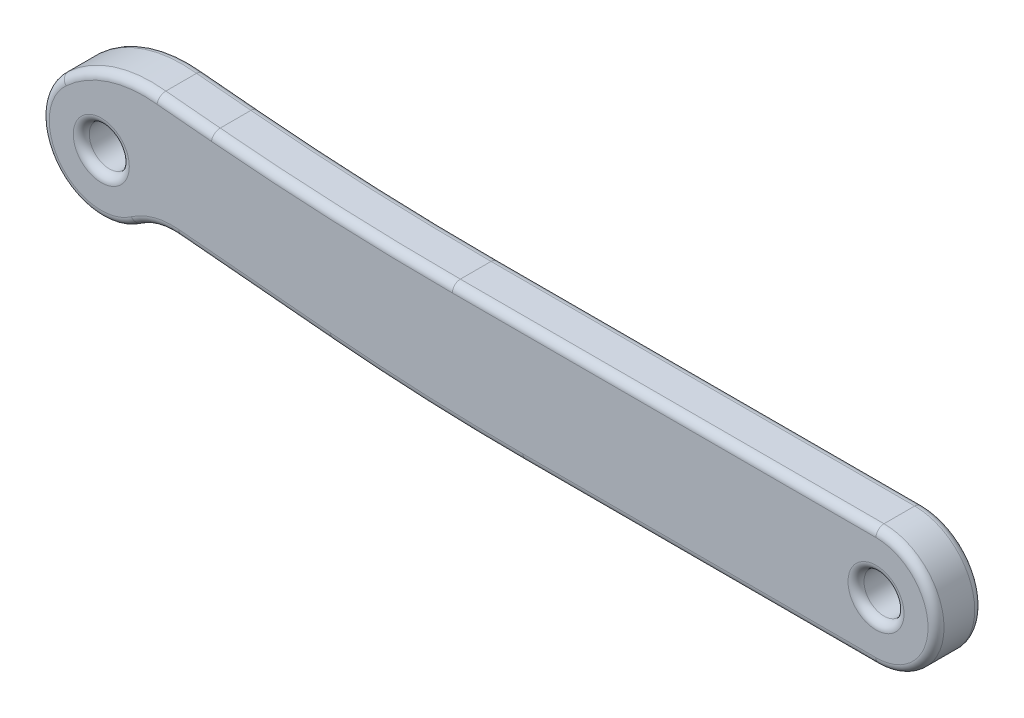
ISO-10303-21;
HEADER;
FILE_DESCRIPTION(('STEP AP214'),'2;1');
FILE_NAME('part.step','',(''),(''),'','','');
FILE_SCHEMA(('AUTOMOTIVE_DESIGN { 1 0 10303 214 1 1 1 1 }'));
ENDSEC;
DATA;
#1=APPLICATION_CONTEXT('core data for automotive mechanical design processes');
#2=APPLICATION_PROTOCOL_DEFINITION('international standard','automotive_design',2000,#1);
#3=PRODUCT_CONTEXT('',#1,'mechanical');
#4=PRODUCT('Part','Part','',(#3));
#5=PRODUCT_RELATED_PRODUCT_CATEGORY('part','',(#4));
#6=PRODUCT_DEFINITION_FORMATION('','',#4);
#7=PRODUCT_DEFINITION_CONTEXT('part definition',#1,'design');
#8=PRODUCT_DEFINITION('design','',#6,#7);
#9=PRODUCT_DEFINITION_SHAPE('','',#8);
#10=(LENGTH_UNIT() NAMED_UNIT(*) SI_UNIT(.MILLI.,.METRE.));
#11=(NAMED_UNIT(*) PLANE_ANGLE_UNIT() SI_UNIT($,.RADIAN.));
#12=(NAMED_UNIT(*) SI_UNIT($,.STERADIAN.) SOLID_ANGLE_UNIT());
#13=UNCERTAINTY_MEASURE_WITH_UNIT(LENGTH_MEASURE(1.E-05),#10,'distance_accuracy_value','');
#14=(GEOMETRIC_REPRESENTATION_CONTEXT(3) GLOBAL_UNCERTAINTY_ASSIGNED_CONTEXT((#13)) GLOBAL_UNIT_ASSIGNED_CONTEXT((#10,
#11,#12)) REPRESENTATION_CONTEXT('',''));
#15=CARTESIAN_POINT('',(0.,0.,0.));
#16=DIRECTION('',(0.,0.,1.));
#17=DIRECTION('',(1.,0.,0.));
#18=AXIS2_PLACEMENT_3D('',#15,#16,#17);
#19=CARTESIAN_POINT('',(0.,0.,1.75));
#20=DIRECTION('',(0.,0.,-1.));
#21=DIRECTION('',(-1.,0.,0.));
#22=AXIS2_PLACEMENT_3D('',#19,#20,#21);
#23=CYLINDRICAL_SURFACE('',#22,2.25);
#24=DIRECTION('',(0.,0.,1.));
#25=VECTOR('',#24,1.);
#26=CARTESIAN_POINT('',(-1.52467335470079,1.65465137157816,0.));
#27=LINE('',#26,#25);
#28=CARTESIAN_POINT('',(-1.52467335470079,1.65465137157816,0.3));
#29=VERTEX_POINT('',#28);
#30=CARTESIAN_POINT('',(-1.52467335470079,1.65465137157816,1.45));
#31=VERTEX_POINT('',#30);
#32=EDGE_CURVE('E458',#29,#31,#27,.T.);
#33=ORIENTED_EDGE('',*,*,#32,.F.);
#34=CARTESIAN_POINT('',(0.,0.,0.3));
#35=DIRECTION('',(0.,0.,1.));
#36=DIRECTION('',(1.,0.,0.));
#37=AXIS2_PLACEMENT_3D('',#34,#35,#36);
#38=CIRCLE('',#37,2.25);
#39=CARTESIAN_POINT('',(1.29610472523494,-1.83918801138537,0.3));
#40=VERTEX_POINT('',#39);
#41=EDGE_CURVE('E261',#29,#40,#38,.T.);
#42=ORIENTED_EDGE('',*,*,#41,.T.);
#43=DIRECTION('',(0.,0.,1.));
#44=VECTOR('',#43,1.);
#45=CARTESIAN_POINT('',(1.29610472523494,-1.83918801138537,0.));
#46=LINE('',#45,#44);
#47=CARTESIAN_POINT('',(1.29610472523494,-1.83918801138537,1.45));
#48=VERTEX_POINT('',#47);
#49=EDGE_CURVE('E405',#40,#48,#46,.T.);
#50=ORIENTED_EDGE('',*,*,#49,.T.);
#51=CARTESIAN_POINT('',(0.,0.,1.45));
#52=DIRECTION('',(0.,0.,1.));
#53=DIRECTION('',(1.,0.,0.));
#54=AXIS2_PLACEMENT_3D('',#51,#52,#53);
#55=CIRCLE('',#54,2.25);
#56=EDGE_CURVE('E259',#48,#31,#55,.F.);
#57=ORIENTED_EDGE('',*,*,#56,.T.);
#58=EDGE_LOOP('',(#33,#42,#50,#57));
#59=FACE_BOUND('',#58,.T.);
#60=ADVANCED_FACE('F34',(#59),#23,.T.);
#61=CARTESIAN_POINT('',(0.,2.25,1.75));
#62=DIRECTION('',(0.,-1.,0.));
#63=DIRECTION('',(0.,0.,-1.));
#64=AXIS2_PLACEMENT_3D('',#61,#62,#63);
#65=PLANE('',#64);
#66=DIRECTION('',(0.,0.,-1.));
#67=VECTOR('',#66,1.);
#68=CARTESIAN_POINT('',(29.04588359,2.25,1.75));
#69=LINE('',#68,#67);
#70=CARTESIAN_POINT('',(29.04588359,2.25,1.45));
#71=VERTEX_POINT('',#70);
#72=CARTESIAN_POINT('',(29.04588359,2.25,0.3));
#73=VERTEX_POINT('',#72);
#74=EDGE_CURVE('E403',#71,#73,#69,.T.);
#75=ORIENTED_EDGE('',*,*,#74,.T.);
#76=DIRECTION('',(-1.,0.,0.));
#77=VECTOR('',#76,1.);
#78=CARTESIAN_POINT('',(0.,2.25,0.3));
#79=LINE('',#78,#77);
#80=CARTESIAN_POINT('',(13.162158488708,2.25,0.3));
#81=VERTEX_POINT('',#80);
#82=EDGE_CURVE('E244',#73,#81,#79,.T.);
#83=ORIENTED_EDGE('',*,*,#82,.T.);
#84=DIRECTION('',(0.,0.,1.));
#85=VECTOR('',#84,1.);
#86=CARTESIAN_POINT('',(13.162158488708,2.25,0.));
#87=LINE('',#86,#85);
#88=CARTESIAN_POINT('',(13.162158488708,2.25,1.45));
#89=VERTEX_POINT('',#88);
#90=EDGE_CURVE('E475',#81,#89,#87,.T.);
#91=ORIENTED_EDGE('',*,*,#90,.T.);
#92=DIRECTION('',(-1.,0.,0.));
#93=VECTOR('',#92,1.);
#94=CARTESIAN_POINT('',(29.04588359,2.25,1.45));
#95=LINE('',#94,#93);
#96=EDGE_CURVE('E242',#89,#71,#95,.F.);
#97=ORIENTED_EDGE('',*,*,#96,.T.);
#98=EDGE_LOOP('',(#75,#83,#91,#97));
#99=FACE_BOUND('',#98,.T.);
#100=ADVANCED_FACE('F479',(#99),#65,.F.);
#101=CARTESIAN_POINT('',(0.,-2.25,1.75));
#102=DIRECTION('',(0.,1.,0.));
#103=DIRECTION('',(0.,0.,1.));
#104=AXIS2_PLACEMENT_3D('',#101,#102,#103);
#105=PLANE('',#104);
#106=DIRECTION('',(0.,0.,1.));
#107=VECTOR('',#106,1.);
#108=CARTESIAN_POINT('',(15.8071767602875,-2.25000000000006,0.));
#109=LINE('',#108,#107);
#110=CARTESIAN_POINT('',(15.8071767602875,-2.25000000000006,0.3));
#111=VERTEX_POINT('',#110);
#112=CARTESIAN_POINT('',(15.8071767602875,-2.25000000000006,1.45));
#113=VERTEX_POINT('',#112);
#114=EDGE_CURVE('E395',#111,#113,#109,.T.);
#115=ORIENTED_EDGE('',*,*,#114,.F.);
#116=DIRECTION('',(1.,0.,0.));
#117=VECTOR('',#116,1.);
#118=CARTESIAN_POINT('',(0.,-2.25,0.3));
#119=LINE('',#118,#117);
#120=CARTESIAN_POINT('',(29.04588359,-2.25,0.3));
#121=VERTEX_POINT('',#120);
#122=EDGE_CURVE('E236',#111,#121,#119,.T.);
#123=ORIENTED_EDGE('',*,*,#122,.T.);
#124=DIRECTION('',(0.,0.,-1.));
#125=VECTOR('',#124,1.);
#126=CARTESIAN_POINT('',(29.04588359,-2.25,1.75));
#127=LINE('',#126,#125);
#128=CARTESIAN_POINT('',(29.04588359,-2.25,1.45));
#129=VERTEX_POINT('',#128);
#130=EDGE_CURVE('E195',#129,#121,#127,.T.);
#131=ORIENTED_EDGE('',*,*,#130,.F.);
#132=DIRECTION('',(1.,0.,0.));
#133=VECTOR('',#132,1.);
#134=CARTESIAN_POINT('',(15.8071767602875,-2.25,1.45));
#135=LINE('',#134,#133);
#136=EDGE_CURVE('E234',#129,#113,#135,.F.);
#137=ORIENTED_EDGE('',*,*,#136,.T.);
#138=EDGE_LOOP('',(#115,#123,#131,#137));
#139=FACE_BOUND('',#138,.T.);
#140=ADVANCED_FACE('F495',(#139),#105,.F.);
#141=CARTESIAN_POINT('',(0.,0.,1.75));
#142=DIRECTION('',(0.,0.,1.));
#143=DIRECTION('',(1.,0.,0.));
#144=AXIS2_PLACEMENT_3D('',#141,#142,#143);
#145=PLANE('',#144);
#146=CARTESIAN_POINT('',(29.04588359,0.,1.75));
#147=DIRECTION('',(0.,0.,1.));
#148=DIRECTION('',(1.,0.,0.));
#149=AXIS2_PLACEMENT_3D('',#146,#147,#148);
#150=CIRCLE('',#149,1.05);
#151=CARTESIAN_POINT('',(30.09588359,0.,1.75));
#152=VERTEX_POINT('',#151);
#153=EDGE_CURVE('E12',#152,#152,#150,.F.);
#154=ORIENTED_EDGE('',*,*,#153,.T.);
#155=EDGE_LOOP('',(#154));
#156=FACE_BOUND('',#155,.T.);
#157=CARTESIAN_POINT('',(0.,0.,1.75));
#158=DIRECTION('',(0.,0.,1.));
#159=DIRECTION('',(1.,0.,0.));
#160=AXIS2_PLACEMENT_3D('',#157,#158,#159);
#161=CIRCLE('',#160,1.05);
#162=CARTESIAN_POINT('',(1.05,0.,1.75));
#163=VERTEX_POINT('',#162);
#164=EDGE_CURVE('E43',#163,#163,#161,.F.);
#165=ORIENTED_EDGE('',*,*,#164,.T.);
#166=EDGE_LOOP('',(#165));
#167=FACE_BOUND('',#166,.T.);
#168=CARTESIAN_POINT('',(13.162158488708,102.934591607014,1.75));
#169=DIRECTION('',(0.,0.,1.));
#170=DIRECTION('',(1.,0.,0.));
#171=AXIS2_PLACEMENT_3D('',#168,#169,#170);
#172=CIRCLE('',#171,100.984591607014);
#173=CARTESIAN_POINT('',(13.162158488708,1.95,1.75));
#174=VERTEX_POINT('',#173);
#175=CARTESIAN_POINT('',(4.1328255389998,2.35447981288885,1.75));
#176=VERTEX_POINT('',#175);
#177=EDGE_CURVE('E51',#174,#176,#172,.F.);
#178=ORIENTED_EDGE('',*,*,#177,.T.);
#179=DIRECTION('',(-0.995994638325983,0.0894129768316409,0.));
#180=VECTOR('',#179,1.);
#181=CARTESIAN_POINT('',(0.242718455459598,2.70370463915676,1.75));
#182=LINE('',#181,#180);
#183=CARTESIAN_POINT('',(2.09015922776099,2.53785517309011,1.75));
#184=VERTEX_POINT('',#183);
#185=EDGE_CURVE('E279',#176,#184,#182,.T.);
#186=ORIENTED_EDGE('',*,*,#185,.T.);
#187=CARTESIAN_POINT('',(1.58269722959737,-1.71762176709653,1.75));
#188=DIRECTION('',(0.,0.,1.));
#189=DIRECTION('',(1.,0.,0.));
#190=AXIS2_PLACEMENT_3D('',#187,#188,#189);
#191=CIRCLE('',#190,4.28562733657985);
#192=CARTESIAN_POINT('',(-1.32138357407402,1.43403118870108,1.75));
#193=VERTEX_POINT('',#192);
#194=EDGE_CURVE('E263',#184,#193,#191,.T.);
#195=ORIENTED_EDGE('',*,*,#194,.T.);
#196=CARTESIAN_POINT('',(0.,0.,1.75));
#197=DIRECTION('',(0.,0.,1.));
#198=DIRECTION('',(1.,0.,0.));
#199=AXIS2_PLACEMENT_3D('',#196,#197,#198);
#200=CIRCLE('',#199,1.95);
#201=CARTESIAN_POINT('',(1.12329076187028,-1.59396294320065,1.75));
#202=VERTEX_POINT('',#201);
#203=EDGE_CURVE('E265',#193,#202,#200,.T.);
#204=ORIENTED_EDGE('',*,*,#203,.T.);
#205=CARTESIAN_POINT('',(2.66557638606268,-3.78248457646024,1.75));
#206=DIRECTION('',(0.,0.,1.));
#207=DIRECTION('',(1.,0.,0.));
#208=AXIS2_PLACEMENT_3D('',#205,#206,#207);
#209=CIRCLE('',#208,2.67736286032277);
#210=CARTESIAN_POINT('',(2.90496736946259,-1.11584552272564,1.75));
#211=VERTEX_POINT('',#210);
#212=EDGE_CURVE('E267',#202,#211,#209,.F.);
#213=ORIENTED_EDGE('',*,*,#212,.T.);
#214=DIRECTION('',(0.995994638325983,-0.0894129768316325,0.));
#215=VECTOR('',#214,1.);
#216=CARTESIAN_POINT('',(-0.0761471648852078,-0.848223274035544,1.75));
#217=LINE('',#216,#215);
#218=CARTESIAN_POINT('',(8.60095043109571,-1.62718843756218,1.75));
#219=VERTEX_POINT('',#218);
#220=EDGE_CURVE('E269',#211,#219,#217,.T.);
#221=ORIENTED_EDGE('',*,*,#220,.T.);
#222=CARTESIAN_POINT('',(15.8071767602885,78.6448597680787,1.75));
#223=DIRECTION('',(0.,0.,1.));
#224=DIRECTION('',(1.,0.,0.));
#225=AXIS2_PLACEMENT_3D('',#222,#223,#224);
#226=CIRCLE('',#225,80.5948597680787);
#227=CARTESIAN_POINT('',(15.8071767602875,-1.95000000000006,1.75));
#228=VERTEX_POINT('',#227);
#229=EDGE_CURVE('E271',#219,#228,#226,.T.);
#230=ORIENTED_EDGE('',*,*,#229,.T.);
#231=DIRECTION('',(1.,0.,0.));
#232=VECTOR('',#231,1.);
#233=CARTESIAN_POINT('',(29.04588359,-1.95,1.75));
#234=LINE('',#233,#232);
#235=CARTESIAN_POINT('',(29.04588359,-1.95,1.75));
#236=VERTEX_POINT('',#235);
#237=EDGE_CURVE('E273',#228,#236,#234,.T.);
#238=ORIENTED_EDGE('',*,*,#237,.T.);
#239=CARTESIAN_POINT('',(29.04588359,0.,1.75));
#240=DIRECTION('',(0.,0.,1.));
#241=DIRECTION('',(1.,0.,0.));
#242=AXIS2_PLACEMENT_3D('',#239,#240,#241);
#243=CIRCLE('',#242,1.95);
#244=CARTESIAN_POINT('',(29.04588359,1.95,1.75));
#245=VERTEX_POINT('',#244);
#246=EDGE_CURVE('E275',#236,#245,#243,.T.);
#247=ORIENTED_EDGE('',*,*,#246,.T.);
#248=DIRECTION('',(-1.,0.,0.));
#249=VECTOR('',#248,1.);
#250=CARTESIAN_POINT('',(13.162158488708,1.95,1.75));
#251=LINE('',#250,#249);
#252=EDGE_CURVE('E56',#245,#174,#251,.T.);
#253=ORIENTED_EDGE('',*,*,#252,.T.);
#254=EDGE_LOOP('',(#178,#186,#195,#204,#213,#221,#230,#238,#247,#253));
#255=FACE_BOUND('',#254,.T.);
#256=ADVANCED_FACE('F719',(#156,#167,#255),#145,.T.);
#257=CARTESIAN_POINT('',(0.,0.,0.));
#258=DIRECTION('',(0.,0.,1.));
#259=DIRECTION('',(1.,0.,0.));
#260=AXIS2_PLACEMENT_3D('',#257,#258,#259);
#261=PLANE('',#260);
#262=CARTESIAN_POINT('',(29.04588359,0.,0.));
#263=DIRECTION('',(0.,0.,1.));
#264=DIRECTION('',(1.,0.,0.));
#265=AXIS2_PLACEMENT_3D('',#262,#263,#264);
#266=CIRCLE('',#265,1.05);
#267=CARTESIAN_POINT('',(30.09588359,0.,0.));
#268=VERTEX_POINT('',#267);
#269=EDGE_CURVE('E203',#268,#268,#266,.T.);
#270=ORIENTED_EDGE('',*,*,#269,.T.);
#271=EDGE_LOOP('',(#270));
#272=FACE_BOUND('',#271,.T.);
#273=CARTESIAN_POINT('',(0.,0.,0.));
#274=DIRECTION('',(0.,0.,1.));
#275=DIRECTION('',(1.,0.,0.));
#276=AXIS2_PLACEMENT_3D('',#273,#274,#275);
#277=CIRCLE('',#276,1.05);
#278=CARTESIAN_POINT('',(1.05,0.,0.));
#279=VERTEX_POINT('',#278);
#280=EDGE_CURVE('E200',#279,#279,#277,.T.);
#281=ORIENTED_EDGE('',*,*,#280,.T.);
#282=EDGE_LOOP('',(#281));
#283=FACE_BOUND('',#282,.T.);
#284=DIRECTION('',(0.995994638325983,-0.0894129768316325,0.));
#285=VECTOR('',#284,1.);
#286=CARTESIAN_POINT('',(2.90496736946259,-1.11584552272564,0.));
#287=LINE('',#286,#285);
#288=CARTESIAN_POINT('',(8.60095043109571,-1.62718843756216,0.));
#289=VERTEX_POINT('',#288);
#290=CARTESIAN_POINT('',(2.90496736946259,-1.11584552272564,0.));
#291=VERTEX_POINT('',#290);
#292=EDGE_CURVE('E199',#289,#291,#287,.F.);
#293=ORIENTED_EDGE('',*,*,#292,.T.);
#294=CARTESIAN_POINT('',(2.66557638606268,-3.78248457646024,0.));
#295=DIRECTION('',(0.,0.,1.));
#296=DIRECTION('',(1.,0.,0.));
#297=AXIS2_PLACEMENT_3D('',#294,#295,#296);
#298=CIRCLE('',#297,2.67736286032277);
#299=CARTESIAN_POINT('',(1.12329076187028,-1.59396294320065,0.));
#300=VERTEX_POINT('',#299);
#301=EDGE_CURVE('E178',#291,#300,#298,.T.);
#302=ORIENTED_EDGE('',*,*,#301,.T.);
#303=CARTESIAN_POINT('',(0.,0.,0.));
#304=DIRECTION('',(0.,0.,1.));
#305=DIRECTION('',(1.,0.,0.));
#306=AXIS2_PLACEMENT_3D('',#303,#304,#305);
#307=CIRCLE('',#306,1.95);
#308=CARTESIAN_POINT('',(-1.32138357407401,1.43403118870107,0.));
#309=VERTEX_POINT('',#308);
#310=EDGE_CURVE('E188',#300,#309,#307,.F.);
#311=ORIENTED_EDGE('',*,*,#310,.T.);
#312=CARTESIAN_POINT('',(1.58269722959737,-1.71762176709653,0.));
#313=DIRECTION('',(0.,0.,1.));
#314=DIRECTION('',(1.,0.,0.));
#315=AXIS2_PLACEMENT_3D('',#312,#313,#314);
#316=CIRCLE('',#315,4.28562733657985);
#317=CARTESIAN_POINT('',(2.090159227761,2.53785517309011,0.));
#318=VERTEX_POINT('',#317);
#319=EDGE_CURVE('E194',#309,#318,#316,.F.);
#320=ORIENTED_EDGE('',*,*,#319,.T.);
#321=DIRECTION('',(-0.995994638325983,0.0894129768316409,0.));
#322=VECTOR('',#321,1.);
#323=CARTESIAN_POINT('',(4.13282553899979,2.35447981288883,0.));
#324=LINE('',#323,#322);
#325=CARTESIAN_POINT('',(4.1328255389998,2.35447981288883,0.));
#326=VERTEX_POINT('',#325);
#327=EDGE_CURVE('E417',#318,#326,#324,.F.);
#328=ORIENTED_EDGE('',*,*,#327,.T.);
#329=CARTESIAN_POINT('',(13.162158488708,102.934591607014,0.));
#330=DIRECTION('',(0.,0.,1.));
#331=DIRECTION('',(1.,0.,0.));
#332=AXIS2_PLACEMENT_3D('',#329,#330,#331);
#333=CIRCLE('',#332,100.984591607014);
#334=CARTESIAN_POINT('',(13.162158488708,1.95,0.));
#335=VERTEX_POINT('',#334);
#336=EDGE_CURVE('E419',#326,#335,#333,.T.);
#337=ORIENTED_EDGE('',*,*,#336,.T.);
#338=DIRECTION('',(-1.,0.,0.));
#339=VECTOR('',#338,1.);
#340=CARTESIAN_POINT('',(0.,1.95,0.));
#341=LINE('',#340,#339);
#342=CARTESIAN_POINT('',(29.04588359,1.95,0.));
#343=VERTEX_POINT('',#342);
#344=EDGE_CURVE('E421',#335,#343,#341,.F.);
#345=ORIENTED_EDGE('',*,*,#344,.T.);
#346=CARTESIAN_POINT('',(29.04588359,0.,0.));
#347=DIRECTION('',(0.,0.,1.));
#348=DIRECTION('',(1.,0.,0.));
#349=AXIS2_PLACEMENT_3D('',#346,#347,#348);
#350=CIRCLE('',#349,1.95);
#351=CARTESIAN_POINT('',(29.04588359,-1.95,0.));
#352=VERTEX_POINT('',#351);
#353=EDGE_CURVE('E423',#343,#352,#350,.F.);
#354=ORIENTED_EDGE('',*,*,#353,.T.);
#355=DIRECTION('',(1.,0.,0.));
#356=VECTOR('',#355,1.);
#357=CARTESIAN_POINT('',(0.,-1.95,0.));
#358=LINE('',#357,#356);
#359=CARTESIAN_POINT('',(15.8071767602875,-1.95,0.));
#360=VERTEX_POINT('',#359);
#361=EDGE_CURVE('E425',#352,#360,#358,.F.);
#362=ORIENTED_EDGE('',*,*,#361,.T.);
#363=CARTESIAN_POINT('',(15.8071767602885,78.6448597680787,0.));
#364=DIRECTION('',(0.,0.,1.));
#365=DIRECTION('',(1.,0.,0.));
#366=AXIS2_PLACEMENT_3D('',#363,#364,#365);
#367=CIRCLE('',#366,80.5948597680787);
#368=EDGE_CURVE('E205',#360,#289,#367,.F.);
#369=ORIENTED_EDGE('',*,*,#368,.T.);
#370=EDGE_LOOP('',(#293,#302,#311,#320,#328,#337,#345,#354,#362,#369));
#371=FACE_BOUND('',#370,.T.);
#372=ADVANCED_FACE('F197',(#272,#283,#371),#261,.F.);
#373=CARTESIAN_POINT('',(29.04588359,0.,1.75));
#374=DIRECTION('',(0.,0.,-1.));
#375=DIRECTION('',(-1.,0.,0.));
#376=AXIS2_PLACEMENT_3D('',#373,#374,#375);
#377=CYLINDRICAL_SURFACE('',#376,2.25);
#378=ORIENTED_EDGE('',*,*,#130,.T.);
#379=CARTESIAN_POINT('',(29.04588359,0.,0.3));
#380=DIRECTION('',(0.,0.,1.));
#381=DIRECTION('',(1.,0.,0.));
#382=AXIS2_PLACEMENT_3D('',#379,#380,#381);
#383=CIRCLE('',#382,2.25);
#384=EDGE_CURVE('E240',#121,#73,#383,.T.);
#385=ORIENTED_EDGE('',*,*,#384,.T.);
#386=ORIENTED_EDGE('',*,*,#74,.F.);
#387=CARTESIAN_POINT('',(29.04588359,0.,1.45));
#388=DIRECTION('',(0.,0.,1.));
#389=DIRECTION('',(1.,0.,0.));
#390=AXIS2_PLACEMENT_3D('',#387,#388,#389);
#391=CIRCLE('',#390,2.25);
#392=EDGE_CURVE('E238',#71,#129,#391,.F.);
#393=ORIENTED_EDGE('',*,*,#392,.T.);
#394=EDGE_LOOP('',(#378,#385,#386,#393));
#395=FACE_BOUND('',#394,.T.);
#396=ADVANCED_FACE('F492',(#395),#377,.T.);
#397=CARTESIAN_POINT('',(0.,0.,1.75));
#398=DIRECTION('',(0.,0.,-1.));
#399=DIRECTION('',(-1.,0.,0.));
#400=AXIS2_PLACEMENT_3D('',#397,#398,#399);
#401=CYLINDRICAL_SURFACE('',#400,0.75);
#402=CARTESIAN_POINT('',(0.,0.,0.3));
#403=DIRECTION('',(0.,0.,1.));
#404=DIRECTION('',(1.,0.,0.));
#405=AXIS2_PLACEMENT_3D('',#402,#403,#404);
#406=CIRCLE('',#405,0.75);
#407=CARTESIAN_POINT('',(0.75,0.,0.3));
#408=VERTEX_POINT('',#407);
#409=EDGE_CURVE('E220',#408,#408,#406,.F.);
#410=ORIENTED_EDGE('',*,*,#409,.T.);
#411=EDGE_LOOP('',(#410));
#412=FACE_BOUND('',#411,.T.);
#413=CARTESIAN_POINT('',(0.,0.,1.45));
#414=DIRECTION('',(0.,0.,1.));
#415=DIRECTION('',(1.,0.,0.));
#416=AXIS2_PLACEMENT_3D('',#413,#414,#415);
#417=CIRCLE('',#416,0.75);
#418=CARTESIAN_POINT('',(0.75,0.,1.45));
#419=VERTEX_POINT('',#418);
#420=EDGE_CURVE('E217',#419,#419,#417,.T.);
#421=ORIENTED_EDGE('',*,*,#420,.T.);
#422=EDGE_LOOP('',(#421));
#423=FACE_BOUND('',#422,.T.);
#424=ADVANCED_FACE('F765',(#412,#423),#401,.F.);
#425=CARTESIAN_POINT('',(29.04588359,0.,1.75));
#426=DIRECTION('',(0.,0.,-1.));
#427=DIRECTION('',(-1.,0.,0.));
#428=AXIS2_PLACEMENT_3D('',#425,#426,#427);
#429=CYLINDRICAL_SURFACE('',#428,0.750000000000002);
#430=CARTESIAN_POINT('',(29.04588359,0.,0.3));
#431=DIRECTION('',(0.,0.,1.));
#432=DIRECTION('',(1.,0.,0.));
#433=AXIS2_PLACEMENT_3D('',#430,#431,#432);
#434=CIRCLE('',#433,0.750000000000002);
#435=CARTESIAN_POINT('',(29.79588359,0.,0.3));
#436=VERTEX_POINT('',#435);
#437=EDGE_CURVE('E214',#436,#436,#434,.F.);
#438=ORIENTED_EDGE('',*,*,#437,.T.);
#439=EDGE_LOOP('',(#438));
#440=FACE_BOUND('',#439,.T.);
#441=CARTESIAN_POINT('',(29.04588359,0.,1.45));
#442=DIRECTION('',(0.,0.,1.));
#443=DIRECTION('',(1.,0.,0.));
#444=AXIS2_PLACEMENT_3D('',#441,#442,#443);
#445=CIRCLE('',#444,0.750000000000002);
#446=CARTESIAN_POINT('',(29.79588359,0.,1.45));
#447=VERTEX_POINT('',#446);
#448=EDGE_CURVE('E211',#447,#447,#445,.T.);
#449=ORIENTED_EDGE('',*,*,#448,.T.);
#450=EDGE_LOOP('',(#449));
#451=FACE_BOUND('',#450,.T.);
#452=ADVANCED_FACE('F770',(#440,#451),#429,.F.);
#453=CARTESIAN_POINT('',(15.8071767602885,78.6448597680787,0.));
#454=DIRECTION('',(0.,0.,1.));
#455=DIRECTION('',(1.,0.,0.));
#456=AXIS2_PLACEMENT_3D('',#453,#454,#455);
#457=CYLINDRICAL_SURFACE('',#456,80.8948597680787);
#458=DIRECTION('',(0.,0.,1.));
#459=VECTOR('',#458,1.);
#460=CARTESIAN_POINT('',(8.57412653804622,-1.92598682905998,0.));
#461=LINE('',#460,#459);
#462=CARTESIAN_POINT('',(8.57412653804622,-1.92598682905998,0.3));
#463=VERTEX_POINT('',#462);
#464=CARTESIAN_POINT('',(8.57412653804622,-1.92598682905998,1.45));
#465=VERTEX_POINT('',#464);
#466=EDGE_CURVE('E392',#463,#465,#461,.T.);
#467=ORIENTED_EDGE('',*,*,#466,.F.);
#468=CARTESIAN_POINT('',(15.8071767602885,78.6448597680787,0.3));
#469=DIRECTION('',(0.,0.,1.));
#470=DIRECTION('',(1.,0.,0.));
#471=AXIS2_PLACEMENT_3D('',#468,#469,#470);
#472=CIRCLE('',#471,80.8948597680787);
#473=EDGE_CURVE('E232',#463,#111,#472,.T.);
#474=ORIENTED_EDGE('',*,*,#473,.T.);
#475=ORIENTED_EDGE('',*,*,#114,.T.);
#476=CARTESIAN_POINT('',(15.8071767602885,78.6448597680787,1.45));
#477=DIRECTION('',(0.,0.,1.));
#478=DIRECTION('',(1.,0.,0.));
#479=AXIS2_PLACEMENT_3D('',#476,#477,#478);
#480=CIRCLE('',#479,80.8948597680787);
#481=EDGE_CURVE('E230',#113,#465,#480,.F.);
#482=ORIENTED_EDGE('',*,*,#481,.T.);
#483=EDGE_LOOP('',(#467,#474,#475,#482));
#484=FACE_BOUND('',#483,.T.);
#485=ADVANCED_FACE('F391',(#484),#457,.T.);
#486=CARTESIAN_POINT('',(2.8781434764131,-1.41464391422344,0.));
#487=DIRECTION('',(-0.0894129768316325,-0.995994638325983,0.));
#488=DIRECTION('',(0.995994638325983,-0.0894129768316325,0.));
#489=AXIS2_PLACEMENT_3D('',#486,#487,#488);
#490=PLANE('',#489);
#491=DIRECTION('',(0.,0.,1.));
#492=VECTOR('',#491,1.);
#493=CARTESIAN_POINT('',(2.8781434764131,-1.41464391422344,0.));
#494=LINE('',#493,#492);
#495=CARTESIAN_POINT('',(2.8781434764131,-1.41464391422344,0.3));
#496=VERTEX_POINT('',#495);
#497=CARTESIAN_POINT('',(2.8781434764131,-1.41464391422344,1.45));
#498=VERTEX_POINT('',#497);
#499=EDGE_CURVE('E401',#496,#498,#494,.T.);
#500=ORIENTED_EDGE('',*,*,#499,.F.);
#501=DIRECTION('',(0.995994638325983,-0.0894129768316325,0.));
#502=VECTOR('',#501,1.);
#503=CARTESIAN_POINT('',(8.57412653804622,-1.92598682905998,0.3));
#504=LINE('',#503,#502);
#505=EDGE_CURVE('E228',#496,#463,#504,.T.);
#506=ORIENTED_EDGE('',*,*,#505,.T.);
#507=ORIENTED_EDGE('',*,*,#466,.T.);
#508=DIRECTION('',(0.995994638325983,-0.0894129768316325,0.));
#509=VECTOR('',#508,1.);
#510=CARTESIAN_POINT('',(2.8781434764131,-1.41464391422344,1.45));
#511=LINE('',#510,#509);
#512=EDGE_CURVE('E226',#465,#498,#511,.F.);
#513=ORIENTED_EDGE('',*,*,#512,.T.);
#514=EDGE_LOOP('',(#500,#506,#507,#513));
#515=FACE_BOUND('',#514,.T.);
#516=ADVANCED_FACE('F398',(#515),#490,.T.);
#517=CARTESIAN_POINT('',(2.66557638606268,-3.78248457646024,0.));
#518=DIRECTION('',(0.,0.,1.));
#519=DIRECTION('',(1.,0.,0.));
#520=AXIS2_PLACEMENT_3D('',#517,#518,#519);
#521=CYLINDRICAL_SURFACE('',#520,2.37736286032277);
#522=ORIENTED_EDGE('',*,*,#49,.F.);
#523=CARTESIAN_POINT('',(2.66557638606268,-3.78248457646024,0.3));
#524=DIRECTION('',(0.,0.,1.));
#525=DIRECTION('',(1.,0.,0.));
#526=AXIS2_PLACEMENT_3D('',#523,#524,#525);
#527=CIRCLE('',#526,2.37736286032277);
#528=EDGE_CURVE('E181',#40,#496,#527,.F.);
#529=ORIENTED_EDGE('',*,*,#528,.T.);
#530=ORIENTED_EDGE('',*,*,#499,.T.);
#531=CARTESIAN_POINT('',(2.66557638606268,-3.78248457646024,1.45));
#532=DIRECTION('',(0.,0.,1.));
#533=DIRECTION('',(1.,0.,0.));
#534=AXIS2_PLACEMENT_3D('',#531,#532,#533);
#535=CIRCLE('',#534,2.37736286032277);
#536=EDGE_CURVE('E223',#498,#48,#535,.T.);
#537=ORIENTED_EDGE('',*,*,#536,.T.);
#538=EDGE_LOOP('',(#522,#529,#530,#537));
#539=FACE_BOUND('',#538,.T.);
#540=ADVANCED_FACE('F435',(#539),#521,.F.);
#541=CARTESIAN_POINT('',(1.58269722959737,-1.71762176709653,0.));
#542=DIRECTION('',(0.,0.,1.));
#543=DIRECTION('',(1.,0.,0.));
#544=AXIS2_PLACEMENT_3D('',#541,#542,#543);
#545=CYLINDRICAL_SURFACE('',#544,4.58562733657985);
#546=DIRECTION('',(0.,0.,1.));
#547=VECTOR('',#546,1.);
#548=CARTESIAN_POINT('',(2.1212656371183,2.83626911218558,0.));
#549=LINE('',#548,#547);
#550=CARTESIAN_POINT('',(2.1212656371183,2.83626911218558,0.3));
#551=VERTEX_POINT('',#550);
#552=CARTESIAN_POINT('',(2.1212656371183,2.83626911218558,1.45));
#553=VERTEX_POINT('',#552);
#554=EDGE_CURVE('E411',#551,#553,#549,.T.);
#555=ORIENTED_EDGE('',*,*,#554,.F.);
#556=CARTESIAN_POINT('',(1.58269722959737,-1.71762176709653,0.3));
#557=DIRECTION('',(0.,0.,1.));
#558=DIRECTION('',(1.,0.,0.));
#559=AXIS2_PLACEMENT_3D('',#556,#557,#558);
#560=CIRCLE('',#559,4.58562733657985);
#561=EDGE_CURVE('E257',#551,#29,#560,.T.);
#562=ORIENTED_EDGE('',*,*,#561,.T.);
#563=ORIENTED_EDGE('',*,*,#32,.T.);
#564=CARTESIAN_POINT('',(1.58269722959737,-1.71762176709653,1.45));
#565=DIRECTION('',(0.,0.,1.));
#566=DIRECTION('',(1.,0.,0.));
#567=AXIS2_PLACEMENT_3D('',#564,#565,#566);
#568=CIRCLE('',#567,4.58562733657985);
#569=EDGE_CURVE('E255',#31,#553,#568,.F.);
#570=ORIENTED_EDGE('',*,*,#569,.T.);
#571=EDGE_LOOP('',(#555,#562,#563,#570));
#572=FACE_BOUND('',#571,.T.);
#573=ADVANCED_FACE('F456',(#572),#545,.T.);
#574=CARTESIAN_POINT('',(2.1212656371183,2.83626911218558,0.));
#575=DIRECTION('',(0.0894129768316409,0.995994638325982,0.));
#576=DIRECTION('',(-0.995994638325983,0.0894129768316409,0.));
#577=AXIS2_PLACEMENT_3D('',#574,#575,#576);
#578=PLANE('',#577);
#579=DIRECTION('',(0.,0.,1.));
#580=VECTOR('',#579,1.);
#581=CARTESIAN_POINT('',(4.15964943204929,2.65327820438663,0.));
#582=LINE('',#581,#580);
#583=CARTESIAN_POINT('',(4.15964943204929,2.65327820438663,0.3));
#584=VERTEX_POINT('',#583);
#585=CARTESIAN_POINT('',(4.15964943204929,2.65327820438663,1.45));
#586=VERTEX_POINT('',#585);
#587=EDGE_CURVE('E465',#584,#586,#582,.T.);
#588=ORIENTED_EDGE('',*,*,#587,.F.);
#589=DIRECTION('',(-0.995994638325983,0.0894129768316409,0.));
#590=VECTOR('',#589,1.);
#591=CARTESIAN_POINT('',(2.1212656371183,2.83626911218558,0.3));
#592=LINE('',#591,#590);
#593=EDGE_CURVE('E253',#584,#551,#592,.T.);
#594=ORIENTED_EDGE('',*,*,#593,.T.);
#595=ORIENTED_EDGE('',*,*,#554,.T.);
#596=DIRECTION('',(-0.995994638325983,0.0894129768316409,0.));
#597=VECTOR('',#596,1.);
#598=CARTESIAN_POINT('',(2.1212656371183,2.83626911218558,1.45));
#599=LINE('',#598,#597);
#600=EDGE_CURVE('E250',#553,#586,#599,.F.);
#601=ORIENTED_EDGE('',*,*,#600,.T.);
#602=EDGE_LOOP('',(#588,#594,#595,#601));
#603=FACE_BOUND('',#602,.T.);
#604=ADVANCED_FACE('F462',(#603),#578,.T.);
#605=CARTESIAN_POINT('',(13.162158488708,102.934591607014,0.));
#606=DIRECTION('',(0.,0.,1.));
#607=DIRECTION('',(1.,0.,0.));
#608=AXIS2_PLACEMENT_3D('',#605,#606,#607);
#609=CYLINDRICAL_SURFACE('',#608,100.684591607014);
#610=ORIENTED_EDGE('',*,*,#90,.F.);
#611=CARTESIAN_POINT('',(13.162158488708,102.934591607014,0.3));
#612=DIRECTION('',(0.,0.,1.));
#613=DIRECTION('',(1.,0.,0.));
#614=AXIS2_PLACEMENT_3D('',#611,#612,#613);
#615=CIRCLE('',#614,100.684591607014);
#616=EDGE_CURVE('E248',#81,#584,#615,.F.);
#617=ORIENTED_EDGE('',*,*,#616,.T.);
#618=ORIENTED_EDGE('',*,*,#587,.T.);
#619=CARTESIAN_POINT('',(13.162158488708,102.934591607014,1.45));
#620=DIRECTION('',(0.,0.,1.));
#621=DIRECTION('',(1.,0.,0.));
#622=AXIS2_PLACEMENT_3D('',#619,#620,#621);
#623=CIRCLE('',#622,100.684591607014);
#624=EDGE_CURVE('E246',#586,#89,#623,.T.);
#625=ORIENTED_EDGE('',*,*,#624,.T.);
#626=EDGE_LOOP('',(#610,#617,#618,#625));
#627=FACE_BOUND('',#626,.T.);
#628=ADVANCED_FACE('F474',(#627),#609,.F.);
#629=CARTESIAN_POINT('',(29.04588359,0.,0.3));
#630=DIRECTION('',(0.,0.,1.));
#631=DIRECTION('',(1.,0.,0.));
#632=AXIS2_PLACEMENT_3D('',#629,#630,#631);
#633=TOROIDAL_SURFACE('',#632,1.05,0.3);
#634=ORIENTED_EDGE('',*,*,#437,.F.);
#635=EDGE_LOOP('',(#634));
#636=FACE_BOUND('',#635,.T.);
#637=ORIENTED_EDGE('',*,*,#269,.F.);
#638=EDGE_LOOP('',(#637));
#639=FACE_BOUND('',#638,.T.);
#640=ADVANCED_FACE('F526',(#636,#639),#633,.T.);
#641=CARTESIAN_POINT('',(0.,0.,0.3));
#642=DIRECTION('',(0.,0.,1.));
#643=DIRECTION('',(1.,0.,0.));
#644=AXIS2_PLACEMENT_3D('',#641,#642,#643);
#645=TOROIDAL_SURFACE('',#644,1.05,0.3);
#646=ORIENTED_EDGE('',*,*,#409,.F.);
#647=EDGE_LOOP('',(#646));
#648=FACE_BOUND('',#647,.T.);
#649=ORIENTED_EDGE('',*,*,#280,.F.);
#650=EDGE_LOOP('',(#649));
#651=FACE_BOUND('',#650,.T.);
#652=ADVANCED_FACE('F324',(#648,#651),#645,.T.);
#653=CARTESIAN_POINT('',(0.,1.95,0.3));
#654=DIRECTION('',(-1.,0.,0.));
#655=DIRECTION('',(0.,0.,1.));
#656=AXIS2_PLACEMENT_3D('',#653,#654,#655);
#657=CYLINDRICAL_SURFACE('',#656,0.3);
#658=CARTESIAN_POINT('',(29.04588359,1.95,0.3));
#659=DIRECTION('',(1.,0.,0.));
#660=DIRECTION('',(0.,0.,-1.));
#661=AXIS2_PLACEMENT_3D('',#658,#659,#660);
#662=CIRCLE('',#661,0.3);
#663=EDGE_CURVE('E502',#343,#73,#662,.T.);
#664=ORIENTED_EDGE('',*,*,#663,.F.);
#665=ORIENTED_EDGE('',*,*,#344,.F.);
#666=CARTESIAN_POINT('',(13.162158488708,1.95,0.3));
#667=DIRECTION('',(-1.,0.,0.));
#668=DIRECTION('',(0.,0.,1.));
#669=AXIS2_PLACEMENT_3D('',#666,#667,#668);
#670=CIRCLE('',#669,0.3);
#671=EDGE_CURVE('E351',#81,#335,#670,.T.);
#672=ORIENTED_EDGE('',*,*,#671,.F.);
#673=ORIENTED_EDGE('',*,*,#82,.F.);
#674=EDGE_LOOP('',(#664,#665,#672,#673));
#675=FACE_BOUND('',#674,.T.);
#676=ADVANCED_FACE('F320',(#675),#657,.T.);
#677=CARTESIAN_POINT('',(13.162158488708,102.934591607014,0.3));
#678=DIRECTION('',(0.,0.,1.));
#679=DIRECTION('',(1.,0.,0.));
#680=AXIS2_PLACEMENT_3D('',#677,#678,#679);
#681=TOROIDAL_SURFACE('',#680,100.984591607014,0.3);
#682=ORIENTED_EDGE('',*,*,#671,.T.);
#683=ORIENTED_EDGE('',*,*,#336,.F.);
#684=CARTESIAN_POINT('',(4.1328255389998,2.35447981288883,0.3));
#685=DIRECTION('',(-0.995994638325985,0.0894129768316155,0.));
#686=DIRECTION('',(-0.0894129768316155,-0.995994638325985,0.));
#687=AXIS2_PLACEMENT_3D('',#684,#685,#686);
#688=CIRCLE('',#687,0.3);
#689=EDGE_CURVE('E500',#584,#326,#688,.T.);
#690=ORIENTED_EDGE('',*,*,#689,.F.);
#691=ORIENTED_EDGE('',*,*,#616,.F.);
#692=EDGE_LOOP('',(#682,#683,#690,#691));
#693=FACE_BOUND('',#692,.T.);
#694=ADVANCED_FACE('F316',(#693),#681,.T.);
#695=CARTESIAN_POINT('',(29.04588359,0.,0.3));
#696=DIRECTION('',(0.,0.,1.));
#697=DIRECTION('',(1.,0.,0.));
#698=AXIS2_PLACEMENT_3D('',#695,#696,#697);
#699=TOROIDAL_SURFACE('',#698,1.95,0.3);
#700=ORIENTED_EDGE('',*,*,#663,.T.);
#701=ORIENTED_EDGE('',*,*,#384,.F.);
#702=CARTESIAN_POINT('',(29.04588359,-1.95,0.3));
#703=DIRECTION('',(-1.,0.,0.));
#704=DIRECTION('',(0.,0.,1.));
#705=AXIS2_PLACEMENT_3D('',#702,#703,#704);
#706=CIRCLE('',#705,0.3);
#707=EDGE_CURVE('E298',#352,#121,#706,.T.);
#708=ORIENTED_EDGE('',*,*,#707,.F.);
#709=ORIENTED_EDGE('',*,*,#353,.F.);
#710=EDGE_LOOP('',(#700,#701,#708,#709));
#711=FACE_BOUND('',#710,.T.);
#712=ADVANCED_FACE('F313',(#711),#699,.T.);
#713=CARTESIAN_POINT('',(2.09444174406881,2.53747072068778,0.3));
#714=DIRECTION('',(0.995994638325983,-0.0894129768316409,0.));
#715=DIRECTION('',(0.0894129768316409,0.995994638325983,0.));
#716=AXIS2_PLACEMENT_3D('',#713,#714,#715);
#717=CYLINDRICAL_SURFACE('',#716,0.3);
#718=ORIENTED_EDGE('',*,*,#689,.T.);
#719=ORIENTED_EDGE('',*,*,#327,.F.);
#720=CARTESIAN_POINT('',(2.1212656371183,2.83626911218558,0.3));
#721=CARTESIAN_POINT('',(2.12126710195287,2.83628337934528,0.283124440537859));
#722=CARTESIAN_POINT('',(2.1211184200928,2.83485354220135,0.266253169150532));
#723=CARTESIAN_POINT('',(2.12053154773279,2.8292107022637,0.232999427126597));
#724=CARTESIAN_POINT('',(2.1200935611735,2.82499966003562,0.216616620651045));
#725=CARTESIAN_POINT('',(2.11893855650489,2.81389649173755,0.184787236715818));
#726=CARTESIAN_POINT('',(2.11822140327523,2.80700306735997,0.169341116815403));
#727=CARTESIAN_POINT('',(2.11652887849002,2.79073769168995,0.139835502839893));
#728=CARTESIAN_POINT('',(2.11555357627593,2.78136640597713,0.125775637792434));
#729=CARTESIAN_POINT('',(2.11337200336979,2.76041017801023,0.099437705648909));
#730=CARTESIAN_POINT('',(2.11216574638709,2.74882536714996,0.0871595328684971));
#731=CARTESIAN_POINT('',(2.10955543071827,2.72376399312111,0.0647267159621618));
#732=CARTESIAN_POINT('',(2.10815127847255,2.71028653517045,0.0545730819356577));
#733=CARTESIAN_POINT('',(2.10518458184035,2.68182145391088,0.0366799300072639));
#734=CARTESIAN_POINT('',(2.10362194253454,2.66683292564076,0.0289418702620467));
#735=CARTESIAN_POINT('',(2.10038421801758,2.63578936556684,0.0161159886855948));
#736=CARTESIAN_POINT('',(2.09870930362374,2.61973595426647,0.0110242395837027));
#737=CARTESIAN_POINT('',(2.09622393689693,2.59592436137297,0.00563394716786839));
#738=CARTESIAN_POINT('',(2.0954381788849,2.58839759962837,0.00423418368665576));
#739=CARTESIAN_POINT('',(2.09385812048642,2.57326507152639,0.00202077372306828));
#740=CARTESIAN_POINT('',(2.09306382956235,2.56565939294891,0.00120653478892483));
#741=CARTESIAN_POINT('',(2.09156577831875,2.55131760457772,0.000228812353332336));
#742=CARTESIAN_POINT('',(2.09086250929124,2.54458587746702,-6.56929012365607E-07));
#743=CARTESIAN_POINT('',(2.09015922776103,2.53785517309011,0.));
#744=B_SPLINE_CURVE_WITH_KNOTS('',3,(#720,#721,#722,#723,#724,#725,#726,#727,#728,#729,#730,
#731,#732,#733,#734,#735,#736,#737,#738,#739,#740,#741,#742,#743),.UNSPECIFIED.,.F.,.F.,(4,2,2,
2,2,2,2,2,2,2,2,4),(0.,0.0505594169911403,0.101083230923838,0.151631529513352,0.20216626406743,
0.252697999834606,0.303253706298971,0.353839871865443,0.404350748854499,0.427420975572763,
0.450467826153511,0.470768251114433),.UNSPECIFIED.);
#745=EDGE_CURVE('E290',#551,#318,#744,.T.);
#746=ORIENTED_EDGE('',*,*,#745,.F.);
#747=ORIENTED_EDGE('',*,*,#593,.F.);
#748=EDGE_LOOP('',(#718,#719,#746,#747));
#749=FACE_BOUND('',#748,.T.);
#750=ADVANCED_FACE('F300',(#749),#717,.T.);
#751=CARTESIAN_POINT('',(0.,-1.95,0.3));
#752=DIRECTION('',(1.,0.,0.));
#753=DIRECTION('',(0.,0.,-1.));
#754=AXIS2_PLACEMENT_3D('',#751,#752,#753);
#755=CYLINDRICAL_SURFACE('',#754,0.3);
#756=ORIENTED_EDGE('',*,*,#707,.T.);
#757=ORIENTED_EDGE('',*,*,#122,.F.);
#758=CARTESIAN_POINT('',(15.8071767602875,-1.95,0.3));
#759=DIRECTION('',(-1.,0.,0.));
#760=DIRECTION('',(0.,-1.,0.));
#761=AXIS2_PLACEMENT_3D('',#758,#759,#760);
#762=CIRCLE('',#761,0.3);
#763=EDGE_CURVE('E287',#360,#111,#762,.T.);
#764=ORIENTED_EDGE('',*,*,#763,.F.);
#765=ORIENTED_EDGE('',*,*,#361,.F.);
#766=EDGE_LOOP('',(#756,#757,#764,#765));
#767=FACE_BOUND('',#766,.T.);
#768=ADVANCED_FACE('F308',(#767),#755,.T.);
#769=CARTESIAN_POINT('',(1.58269722959737,-1.71762176709653,0.3));
#770=DIRECTION('',(0.,0.,1.));
#771=DIRECTION('',(1.,0.,0.));
#772=AXIS2_PLACEMENT_3D('',#769,#770,#771);
#773=TOROIDAL_SURFACE('',#772,4.28562733657985,0.3);
#774=ORIENTED_EDGE('',*,*,#745,.T.);
#775=ORIENTED_EDGE('',*,*,#319,.F.);
#776=CARTESIAN_POINT('',(-1.32138357407402,1.43403118870108,0.3));
#777=DIRECTION('',(-0.735400609590285,-0.677632602089242,0.));
#778=DIRECTION('',(0.677632602089242,-0.735400609590285,0.));
#779=AXIS2_PLACEMENT_3D('',#776,#777,#778);
#780=CIRCLE('',#779,0.3);
#781=EDGE_CURVE('E191',#29,#309,#780,.T.);
#782=ORIENTED_EDGE('',*,*,#781,.F.);
#783=ORIENTED_EDGE('',*,*,#561,.F.);
#784=EDGE_LOOP('',(#774,#775,#782,#783));
#785=FACE_BOUND('',#784,.T.);
#786=ADVANCED_FACE('F303',(#785),#773,.T.);
#787=CARTESIAN_POINT('',(15.8071767602885,78.6448597680787,0.3));
#788=DIRECTION('',(0.,0.,1.));
#789=DIRECTION('',(1.,0.,0.));
#790=AXIS2_PLACEMENT_3D('',#787,#788,#789);
#791=TOROIDAL_SURFACE('',#790,80.5948597680787,0.3);
#792=ORIENTED_EDGE('',*,*,#763,.T.);
#793=ORIENTED_EDGE('',*,*,#473,.F.);
#794=CARTESIAN_POINT('',(8.60095043109571,-1.62718843756216,0.3));
#795=DIRECTION('',(-0.995994638325984,0.0894129768316284,0.));
#796=DIRECTION('',(-0.0894129768316284,-0.995994638325984,0.));
#797=AXIS2_PLACEMENT_3D('',#794,#795,#796);
#798=CIRCLE('',#797,0.3);
#799=EDGE_CURVE('E184',#289,#463,#798,.T.);
#800=ORIENTED_EDGE('',*,*,#799,.F.);
#801=ORIENTED_EDGE('',*,*,#368,.F.);
#802=EDGE_LOOP('',(#792,#793,#800,#801));
#803=FACE_BOUND('',#802,.T.);
#804=ADVANCED_FACE('F307',(#803),#791,.T.);
#805=CARTESIAN_POINT('',(0.,0.,0.3));
#806=DIRECTION('',(0.,0.,1.));
#807=DIRECTION('',(1.,0.,0.));
#808=AXIS2_PLACEMENT_3D('',#805,#806,#807);
#809=TOROIDAL_SURFACE('',#808,1.95,0.3);
#810=ORIENTED_EDGE('',*,*,#781,.T.);
#811=ORIENTED_EDGE('',*,*,#310,.F.);
#812=CARTESIAN_POINT('',(1.12329076187028,-1.59396294320065,0.3));
#813=DIRECTION('',(0.817416893949051,0.576046544548863,0.));
#814=DIRECTION('',(-0.576046544548863,0.817416893949051,0.));
#815=AXIS2_PLACEMENT_3D('',#812,#813,#814);
#816=CIRCLE('',#815,0.3);
#817=EDGE_CURVE('E174',#40,#300,#816,.T.);
#818=ORIENTED_EDGE('',*,*,#817,.F.);
#819=ORIENTED_EDGE('',*,*,#41,.F.);
#820=EDGE_LOOP('',(#810,#811,#818,#819));
#821=FACE_BOUND('',#820,.T.);
#822=ADVANCED_FACE('F189',(#821),#809,.T.);
#823=CARTESIAN_POINT('',(2.90496736946259,-1.11584552272564,0.3));
#824=DIRECTION('',(-0.995994638325983,0.0894129768316325,0.));
#825=DIRECTION('',(-0.0894129768316325,-0.995994638325983,0.));
#826=AXIS2_PLACEMENT_3D('',#823,#824,#825);
#827=CYLINDRICAL_SURFACE('',#826,0.3);
#828=ORIENTED_EDGE('',*,*,#799,.T.);
#829=ORIENTED_EDGE('',*,*,#505,.F.);
#830=CARTESIAN_POINT('',(2.90496736946259,-1.11584552272564,0.3));
#831=DIRECTION('',(-0.995994638325983,0.0894129768316314,0.));
#832=DIRECTION('',(-0.0894129768316314,-0.995994638325983,0.));
#833=AXIS2_PLACEMENT_3D('',#830,#831,#832);
#834=CIRCLE('',#833,0.3);
#835=EDGE_CURVE('E185',#291,#496,#834,.T.);
#836=ORIENTED_EDGE('',*,*,#835,.F.);
#837=ORIENTED_EDGE('',*,*,#292,.F.);
#838=EDGE_LOOP('',(#828,#829,#836,#837));
#839=FACE_BOUND('',#838,.T.);
#840=ADVANCED_FACE('F432',(#839),#827,.T.);
#841=CARTESIAN_POINT('',(2.66557638606268,-3.78248457646024,0.3));
#842=DIRECTION('',(0.,0.,1.));
#843=DIRECTION('',(1.,0.,0.));
#844=AXIS2_PLACEMENT_3D('',#841,#842,#843);
#845=TOROIDAL_SURFACE('',#844,2.67736286032277,0.3);
#846=ORIENTED_EDGE('',*,*,#817,.T.);
#847=ORIENTED_EDGE('',*,*,#301,.F.);
#848=ORIENTED_EDGE('',*,*,#835,.T.);
#849=ORIENTED_EDGE('',*,*,#528,.F.);
#850=EDGE_LOOP('',(#846,#847,#848,#849));
#851=FACE_BOUND('',#850,.T.);
#852=ADVANCED_FACE('F176',(#851),#845,.T.);
#853=CARTESIAN_POINT('',(29.04588359,0.,1.45));
#854=DIRECTION('',(0.,0.,1.));
#855=DIRECTION('',(1.,0.,0.));
#856=AXIS2_PLACEMENT_3D('',#853,#854,#855);
#857=TOROIDAL_SURFACE('',#856,1.05,0.3);
#858=ORIENTED_EDGE('',*,*,#153,.F.);
#859=EDGE_LOOP('',(#858));
#860=FACE_BOUND('',#859,.T.);
#861=ORIENTED_EDGE('',*,*,#448,.F.);
#862=EDGE_LOOP('',(#861));
#863=FACE_BOUND('',#862,.T.);
#864=ADVANCED_FACE('F326',(#860,#863),#857,.T.);
#865=CARTESIAN_POINT('',(0.,0.,1.45));
#866=DIRECTION('',(0.,0.,1.));
#867=DIRECTION('',(1.,0.,0.));
#868=AXIS2_PLACEMENT_3D('',#865,#866,#867);
#869=TOROIDAL_SURFACE('',#868,1.05,0.3);
#870=ORIENTED_EDGE('',*,*,#164,.F.);
#871=EDGE_LOOP('',(#870));
#872=FACE_BOUND('',#871,.T.);
#873=ORIENTED_EDGE('',*,*,#420,.F.);
#874=EDGE_LOOP('',(#873));
#875=FACE_BOUND('',#874,.T.);
#876=ADVANCED_FACE('F329',(#872,#875),#869,.T.);
#877=CARTESIAN_POINT('',(15.8071767602885,78.6448597680787,1.45));
#878=DIRECTION('',(0.,0.,1.));
#879=DIRECTION('',(1.,0.,0.));
#880=AXIS2_PLACEMENT_3D('',#877,#878,#879);
#881=TOROIDAL_SURFACE('',#880,80.5948597680787,0.3);
#882=CARTESIAN_POINT('',(8.60095043109571,-1.62718843756214,1.45));
#883=DIRECTION('',(-0.995994638325982,0.0894129768316416,0.));
#884=DIRECTION('',(-0.0894129768316416,-0.995994638325982,0.));
#885=AXIS2_PLACEMENT_3D('',#882,#883,#884);
#886=CIRCLE('',#885,0.3);
#887=EDGE_CURVE('E371',#465,#219,#886,.T.);
#888=ORIENTED_EDGE('',*,*,#887,.F.);
#889=ORIENTED_EDGE('',*,*,#481,.F.);
#890=CARTESIAN_POINT('',(15.8071767602875,-1.95000000000006,1.45));
#891=DIRECTION('',(1.,0.,0.));
#892=DIRECTION('',(0.,0.,-1.));
#893=AXIS2_PLACEMENT_3D('',#890,#891,#892);
#894=CIRCLE('',#893,0.3);
#895=EDGE_CURVE('E38',#228,#113,#894,.T.);
#896=ORIENTED_EDGE('',*,*,#895,.F.);
#897=ORIENTED_EDGE('',*,*,#229,.F.);
#898=EDGE_LOOP('',(#888,#889,#896,#897));
#899=FACE_BOUND('',#898,.T.);
#900=ADVANCED_FACE('F36',(#899),#881,.T.);
#901=CARTESIAN_POINT('',(0.,-1.95,1.45));
#902=DIRECTION('',(-1.,0.,0.));
#903=DIRECTION('',(0.,0.,1.));
#904=AXIS2_PLACEMENT_3D('',#901,#902,#903);
#905=CYLINDRICAL_SURFACE('',#904,0.3);
#906=ORIENTED_EDGE('',*,*,#895,.T.);
#907=ORIENTED_EDGE('',*,*,#136,.F.);
#908=CARTESIAN_POINT('',(29.04588359,-1.95,1.45));
#909=DIRECTION('',(1.,0.,0.));
#910=DIRECTION('',(0.,0.,-1.));
#911=AXIS2_PLACEMENT_3D('',#908,#909,#910);
#912=CIRCLE('',#911,0.3);
#913=EDGE_CURVE('E369',#236,#129,#912,.T.);
#914=ORIENTED_EDGE('',*,*,#913,.F.);
#915=ORIENTED_EDGE('',*,*,#237,.F.);
#916=EDGE_LOOP('',(#906,#907,#914,#915));
#917=FACE_BOUND('',#916,.T.);
#918=ADVANCED_FACE('F382',(#917),#905,.T.);
#919=CARTESIAN_POINT('',(-0.0761471648852078,-0.848223274035544,1.45));
#920=DIRECTION('',(0.995994638325983,-0.0894129768316325,0.));
#921=DIRECTION('',(0.0894129768316325,0.995994638325983,0.));
#922=AXIS2_PLACEMENT_3D('',#919,#920,#921);
#923=CYLINDRICAL_SURFACE('',#922,0.3);
#924=ORIENTED_EDGE('',*,*,#887,.T.);
#925=ORIENTED_EDGE('',*,*,#220,.F.);
#926=CARTESIAN_POINT('',(2.90496736946259,-1.11584552272564,1.45));
#927=DIRECTION('',(-0.995994638325983,0.0894129768316329,0.));
#928=DIRECTION('',(-0.0894129768316329,-0.995994638325983,0.));
#929=AXIS2_PLACEMENT_3D('',#926,#927,#928);
#930=CIRCLE('',#929,0.3);
#931=EDGE_CURVE('E366',#498,#211,#930,.T.);
#932=ORIENTED_EDGE('',*,*,#931,.F.);
#933=ORIENTED_EDGE('',*,*,#512,.F.);
#934=EDGE_LOOP('',(#924,#925,#932,#933));
#935=FACE_BOUND('',#934,.T.);
#936=ADVANCED_FACE('F574',(#935),#923,.T.);
#937=CARTESIAN_POINT('',(29.04588359,0.,1.45));
#938=DIRECTION('',(0.,0.,1.));
#939=DIRECTION('',(1.,0.,0.));
#940=AXIS2_PLACEMENT_3D('',#937,#938,#939);
#941=TOROIDAL_SURFACE('',#940,1.95,0.3);
#942=ORIENTED_EDGE('',*,*,#913,.T.);
#943=ORIENTED_EDGE('',*,*,#392,.F.);
#944=CARTESIAN_POINT('',(29.04588359,1.95,1.45));
#945=DIRECTION('',(-1.,0.,0.));
#946=DIRECTION('',(0.,0.,1.));
#947=AXIS2_PLACEMENT_3D('',#944,#945,#946);
#948=CIRCLE('',#947,0.3);
#949=EDGE_CURVE('E363',#245,#71,#948,.T.);
#950=ORIENTED_EDGE('',*,*,#949,.F.);
#951=ORIENTED_EDGE('',*,*,#246,.F.);
#952=EDGE_LOOP('',(#942,#943,#950,#951));
#953=FACE_BOUND('',#952,.T.);
#954=ADVANCED_FACE('F489',(#953),#941,.T.);
#955=CARTESIAN_POINT('',(2.66557638606268,-3.78248457646024,1.45));
#956=DIRECTION('',(0.,0.,1.));
#957=DIRECTION('',(1.,0.,0.));
#958=AXIS2_PLACEMENT_3D('',#955,#956,#957);
#959=TOROIDAL_SURFACE('',#958,2.67736286032277,0.3);
#960=ORIENTED_EDGE('',*,*,#931,.T.);
#961=ORIENTED_EDGE('',*,*,#212,.F.);
#962=CARTESIAN_POINT('',(1.12329076187028,-1.59396294320065,1.45));
#963=DIRECTION('',(-0.817416893949052,-0.576046544548862,0.));
#964=DIRECTION('',(0.576046544548862,-0.817416893949052,0.));
#965=AXIS2_PLACEMENT_3D('',#962,#963,#964);
#966=CIRCLE('',#965,0.3);
#967=EDGE_CURVE('E360',#48,#202,#966,.T.);
#968=ORIENTED_EDGE('',*,*,#967,.F.);
#969=ORIENTED_EDGE('',*,*,#536,.F.);
#970=EDGE_LOOP('',(#960,#961,#968,#969));
#971=FACE_BOUND('',#970,.T.);
#972=ADVANCED_FACE('F445',(#971),#959,.T.);
#973=CARTESIAN_POINT('',(0.,1.95,1.45));
#974=DIRECTION('',(1.,0.,0.));
#975=DIRECTION('',(0.,0.,-1.));
#976=AXIS2_PLACEMENT_3D('',#973,#974,#975);
#977=CYLINDRICAL_SURFACE('',#976,0.3);
#978=ORIENTED_EDGE('',*,*,#949,.T.);
#979=ORIENTED_EDGE('',*,*,#96,.F.);
#980=CARTESIAN_POINT('',(13.162158488708,1.95,1.45));
#981=DIRECTION('',(-1.,0.,0.));
#982=DIRECTION('',(0.,0.,1.));
#983=AXIS2_PLACEMENT_3D('',#980,#981,#982);
#984=CIRCLE('',#983,0.3);
#985=EDGE_CURVE('E357',#174,#89,#984,.T.);
#986=ORIENTED_EDGE('',*,*,#985,.F.);
#987=ORIENTED_EDGE('',*,*,#252,.F.);
#988=EDGE_LOOP('',(#978,#979,#986,#987));
#989=FACE_BOUND('',#988,.T.);
#990=ADVANCED_FACE('F484',(#989),#977,.T.);
#991=CARTESIAN_POINT('',(0.,0.,1.45));
#992=DIRECTION('',(0.,0.,1.));
#993=DIRECTION('',(1.,0.,0.));
#994=AXIS2_PLACEMENT_3D('',#991,#992,#993);
#995=TOROIDAL_SURFACE('',#994,1.95,0.3);
#996=ORIENTED_EDGE('',*,*,#967,.T.);
#997=ORIENTED_EDGE('',*,*,#203,.F.);
#998=CARTESIAN_POINT('',(-1.32138357407401,1.43403118870107,1.45));
#999=DIRECTION('',(0.735400609590291,0.677632602089235,0.));
#1000=DIRECTION('',(-0.677632602089236,0.735400609590291,0.));
#1001=AXIS2_PLACEMENT_3D('',#998,#999,#1000);
#1002=CIRCLE('',#1001,0.3);
#1003=EDGE_CURVE('E354',#31,#193,#1002,.T.);
#1004=ORIENTED_EDGE('',*,*,#1003,.F.);
#1005=ORIENTED_EDGE('',*,*,#56,.F.);
#1006=EDGE_LOOP('',(#996,#997,#1004,#1005));
#1007=FACE_BOUND('',#1006,.T.);
#1008=ADVANCED_FACE('F449',(#1007),#995,.T.);
#1009=CARTESIAN_POINT('',(13.162158488708,102.934591607014,1.45));
#1010=DIRECTION('',(0.,0.,1.));
#1011=DIRECTION('',(1.,0.,0.));
#1012=AXIS2_PLACEMENT_3D('',#1009,#1010,#1011);
#1013=TOROIDAL_SURFACE('',#1012,100.984591607014,0.3);
#1014=ORIENTED_EDGE('',*,*,#985,.T.);
#1015=ORIENTED_EDGE('',*,*,#624,.F.);
#1016=CARTESIAN_POINT('',(4.1328255389998,2.35447981288885,1.45));
#1017=DIRECTION('',(-0.995994638325982,0.089412976831643,0.));
#1018=DIRECTION('',(-0.089412976831643,-0.995994638325982,0.));
#1019=AXIS2_PLACEMENT_3D('',#1016,#1017,#1018);
#1020=CIRCLE('',#1019,0.3);
#1021=EDGE_CURVE('E350',#176,#586,#1020,.T.);
#1022=ORIENTED_EDGE('',*,*,#1021,.F.);
#1023=ORIENTED_EDGE('',*,*,#177,.F.);
#1024=EDGE_LOOP('',(#1014,#1015,#1022,#1023));
#1025=FACE_BOUND('',#1024,.T.);
#1026=ADVANCED_FACE('F339',(#1025),#1013,.T.);
#1027=CARTESIAN_POINT('',(1.58269722959737,-1.71762176709653,1.45));
#1028=DIRECTION('',(0.,0.,1.));
#1029=DIRECTION('',(1.,0.,0.));
#1030=AXIS2_PLACEMENT_3D('',#1027,#1028,#1029);
#1031=TOROIDAL_SURFACE('',#1030,4.28562733657985,0.3);
#1032=ORIENTED_EDGE('',*,*,#1003,.T.);
#1033=ORIENTED_EDGE('',*,*,#194,.F.);
#1034=CARTESIAN_POINT('',(2.1212656371183,2.83626911218558,1.45));
#1035=CARTESIAN_POINT('',(2.12126710195282,2.83628337934528,1.46687555946214));
#1036=CARTESIAN_POINT('',(2.12111842009274,2.83485354220136,1.48374683084947));
#1037=CARTESIAN_POINT('',(2.12053154773274,2.8292107022637,1.5170005728734));
#1038=CARTESIAN_POINT('',(2.12009356117348,2.82499966003562,1.53338337934896));
#1039=CARTESIAN_POINT('',(2.11893855650488,2.81389649173755,1.56521276328418));
#1040=CARTESIAN_POINT('',(2.1182214032752,2.80700306735997,1.5806588831846));
#1041=CARTESIAN_POINT('',(2.11652887848999,2.79073769168995,1.61016449716011));
#1042=CARTESIAN_POINT('',(2.11555357627591,2.78136640597713,1.62422436220757));
#1043=CARTESIAN_POINT('',(2.11337200336978,2.76041017801023,1.65056229435109));
#1044=CARTESIAN_POINT('',(2.11216574638709,2.74882536714996,1.6628404671315));
#1045=CARTESIAN_POINT('',(2.10955543071826,2.72376399312111,1.68527328403784));
#1046=CARTESIAN_POINT('',(2.10815127847253,2.71028653517045,1.69542691806434));
#1047=CARTESIAN_POINT('',(2.10518458184031,2.68182145391088,1.71332006999274));
#1048=CARTESIAN_POINT('',(2.10362194253449,2.66683292564076,1.72105812973795));
#1049=CARTESIAN_POINT('',(2.10038421801756,2.63578936556684,1.73388401131441));
#1050=CARTESIAN_POINT('',(2.09870930362374,2.61973595426647,1.7389757604163));
#1051=CARTESIAN_POINT('',(2.09622393689691,2.59592436137297,1.74436605283213));
#1052=CARTESIAN_POINT('',(2.09543817888487,2.58839759962837,1.74576581631335));
#1053=CARTESIAN_POINT('',(2.0938581204864,2.57326507152637,1.74797922627693));
#1054=CARTESIAN_POINT('',(2.09306382956235,2.56565939294889,1.74879346521108));
#1055=CARTESIAN_POINT('',(2.09156577831875,2.5513176045777,1.74977118764667));
#1056=CARTESIAN_POINT('',(2.09086250929124,2.544585877467,1.75000065692901));
#1057=CARTESIAN_POINT('',(2.09015922776099,2.53785517309008,1.75));
#1058=B_SPLINE_CURVE_WITH_KNOTS('',3,(#1034,#1035,#1036,#1037,#1038,#1039,#1040,#1041,#1042,
#1043,#1044,#1045,#1046,#1047,#1048,#1049,#1050,#1051,#1052,#1053,#1054,#1055,#1056,#1057),
.UNSPECIFIED.,.F.,.F.,(4,2,2,2,2,2,2,2,2,2,2,4),(0.,0.0505594169911406,0.101083230923839,
0.151631529513353,0.202166264067431,0.252697999834606,0.303253706298971,0.353839871865443,
0.4043507488545,0.427420975572776,0.450467826153536,0.47076825111446),.UNSPECIFIED.);
#1059=EDGE_CURVE('E344',#553,#184,#1058,.T.);
#1060=ORIENTED_EDGE('',*,*,#1059,.F.);
#1061=ORIENTED_EDGE('',*,*,#569,.F.);
#1062=EDGE_LOOP('',(#1032,#1033,#1060,#1061));
#1063=FACE_BOUND('',#1062,.T.);
#1064=ADVANCED_FACE('F334',(#1063),#1031,.T.);
#1065=CARTESIAN_POINT('',(0.242718455459598,2.70370463915676,1.45));
#1066=DIRECTION('',(-0.995994638325983,0.0894129768316409,0.));
#1067=DIRECTION('',(-0.0894129768316409,-0.995994638325983,0.));
#1068=AXIS2_PLACEMENT_3D('',#1065,#1066,#1067);
#1069=CYLINDRICAL_SURFACE('',#1068,0.3);
#1070=ORIENTED_EDGE('',*,*,#1021,.T.);
#1071=ORIENTED_EDGE('',*,*,#600,.F.);
#1072=ORIENTED_EDGE('',*,*,#1059,.T.);
#1073=ORIENTED_EDGE('',*,*,#185,.F.);
#1074=EDGE_LOOP('',(#1070,#1071,#1072,#1073));
#1075=FACE_BOUND('',#1074,.T.);
#1076=ADVANCED_FACE('F338',(#1075),#1069,.T.);
#1077=CLOSED_SHELL('',(#60,#100,#140,#256,#372,#396,#424,#452,#485,#516,#540,#573,#604,#628,
#640,#652,#676,#694,#712,#750,#768,#786,#804,#822,#840,#852,#864,#876,#900,#918,#936,#954,#972,
#990,#1008,#1026,#1064,#1076));
#1078=MANIFOLD_SOLID_BREP('B2',#1077);
#1079=ADVANCED_BREP_SHAPE_REPRESENTATION('',(#18,#1078),#14);
#1080=SHAPE_DEFINITION_REPRESENTATION(#9,#1079);
ENDSEC;
END-ISO-10303-21;
